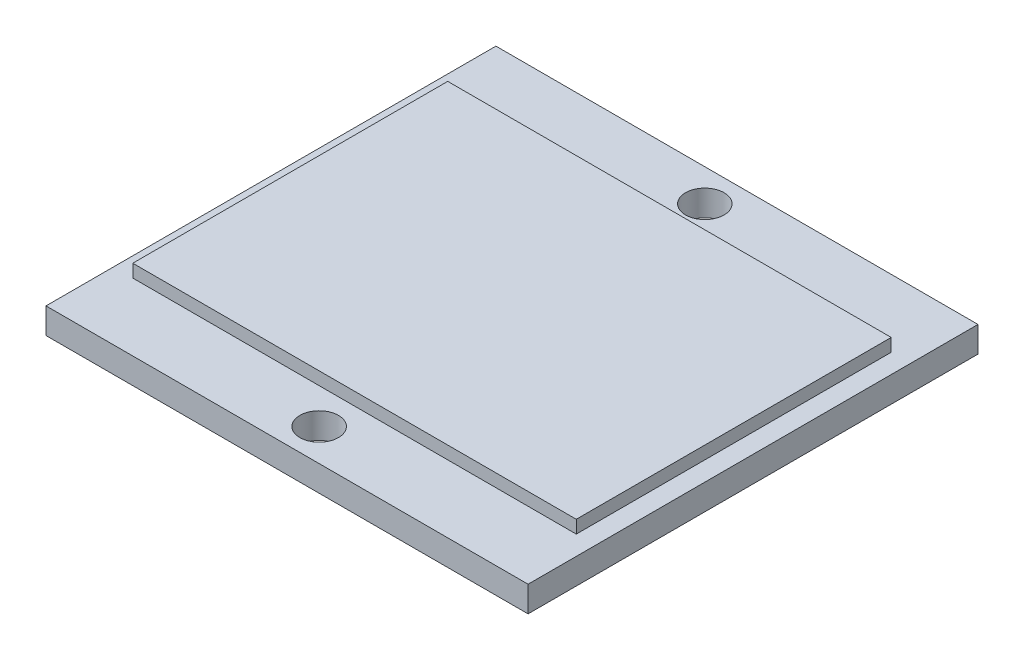
ISO-10303-21;
HEADER;
FILE_DESCRIPTION(('STEP AP214'),'2;1');
FILE_NAME('part.step','',(''),(''),'','','');
FILE_SCHEMA(('AUTOMOTIVE_DESIGN { 1 0 10303 214 1 1 1 1 }'));
ENDSEC;
DATA;
#1=APPLICATION_CONTEXT('core data for automotive mechanical design processes');
#2=APPLICATION_PROTOCOL_DEFINITION('international standard','automotive_design',2000,#1);
#3=PRODUCT_CONTEXT('',#1,'mechanical');
#4=PRODUCT('Part','Part','',(#3));
#5=PRODUCT_RELATED_PRODUCT_CATEGORY('part','',(#4));
#6=PRODUCT_DEFINITION_FORMATION('','',#4);
#7=PRODUCT_DEFINITION_CONTEXT('part definition',#1,'design');
#8=PRODUCT_DEFINITION('design','',#6,#7);
#9=PRODUCT_DEFINITION_SHAPE('','',#8);
#10=(LENGTH_UNIT() NAMED_UNIT(*) SI_UNIT(.MILLI.,.METRE.));
#11=(NAMED_UNIT(*) PLANE_ANGLE_UNIT() SI_UNIT($,.RADIAN.));
#12=(NAMED_UNIT(*) SI_UNIT($,.STERADIAN.) SOLID_ANGLE_UNIT());
#13=UNCERTAINTY_MEASURE_WITH_UNIT(LENGTH_MEASURE(1.E-05),#10,'distance_accuracy_value','');
#14=(GEOMETRIC_REPRESENTATION_CONTEXT(3) GLOBAL_UNCERTAINTY_ASSIGNED_CONTEXT((#13)) GLOBAL_UNIT_ASSIGNED_CONTEXT((#10,
#11,#12)) REPRESENTATION_CONTEXT('',''));
#15=CARTESIAN_POINT('',(0.,0.,0.));
#16=DIRECTION('',(0.,0.,1.));
#17=DIRECTION('',(1.,0.,0.));
#18=AXIS2_PLACEMENT_3D('',#15,#16,#17);
#19=CARTESIAN_POINT('',(0.,4.,0.));
#20=DIRECTION('',(0.,1.,0.));
#21=DIRECTION('',(0.,0.,1.));
#22=AXIS2_PLACEMENT_3D('',#19,#20,#21);
#23=PLANE('',#22);
#24=CARTESIAN_POINT('',(12.5721820460052,4.,45.6524402124825));
#25=DIRECTION('',(0.,1.,0.));
#26=DIRECTION('',(0.,0.,1.));
#27=AXIS2_PLACEMENT_3D('',#24,#25,#26);
#28=CIRCLE('',#27,3.);
#29=CARTESIAN_POINT('',(12.5721820460052,4.,48.6524402124825));
#30=VERTEX_POINT('',#29);
#31=EDGE_CURVE('E212',#30,#30,#28,.T.);
#32=ORIENTED_EDGE('',*,*,#31,.F.);
#33=EDGE_LOOP('',(#32));
#34=FACE_BOUND('',#33,.T.);
#35=CARTESIAN_POINT('',(12.5721820460052,4.,-14.3475597875175));
#36=DIRECTION('',(0.,1.,0.));
#37=DIRECTION('',(0.,0.,1.));
#38=AXIS2_PLACEMENT_3D('',#35,#36,#37);
#39=CIRCLE('',#38,3.);
#40=CARTESIAN_POINT('',(12.5721820460052,4.,-11.3475597875175));
#41=VERTEX_POINT('',#40);
#42=EDGE_CURVE('E214',#41,#41,#39,.T.);
#43=ORIENTED_EDGE('',*,*,#42,.F.);
#44=EDGE_LOOP('',(#43));
#45=FACE_BOUND('',#44,.T.);
#46=DIRECTION('',(0.,0.,1.));
#47=VECTOR('',#46,1.);
#48=CARTESIAN_POINT('',(-24.9278179539948,4.,-19.3475597875175));
#49=LINE('',#48,#47);
#50=CARTESIAN_POINT('',(-24.9278179539948,4.,-19.3475597875175));
#51=VERTEX_POINT('',#50);
#52=CARTESIAN_POINT('',(-24.9278179539948,4.,50.6524402124825));
#53=VERTEX_POINT('',#52);
#54=EDGE_CURVE('E140',#51,#53,#49,.T.);
#55=ORIENTED_EDGE('',*,*,#54,.T.);
#56=DIRECTION('',(1.,0.,0.));
#57=VECTOR('',#56,1.);
#58=CARTESIAN_POINT('',(-24.9278179539948,4.,50.6524402124825));
#59=LINE('',#58,#57);
#60=CARTESIAN_POINT('',(50.0721820460052,4.,50.6524402124825));
#61=VERTEX_POINT('',#60);
#62=EDGE_CURVE('E85',#53,#61,#59,.T.);
#63=ORIENTED_EDGE('',*,*,#62,.T.);
#64=DIRECTION('',(0.,0.,-1.));
#65=VECTOR('',#64,1.);
#66=CARTESIAN_POINT('',(50.0721820460052,4.,-19.3475597875175));
#67=LINE('',#66,#65);
#68=CARTESIAN_POINT('',(50.0721820460052,4.,-19.3475597875175));
#69=VERTEX_POINT('',#68);
#70=EDGE_CURVE('E143',#61,#69,#67,.T.);
#71=ORIENTED_EDGE('',*,*,#70,.T.);
#72=DIRECTION('',(-1.,0.,0.));
#73=VECTOR('',#72,1.);
#74=CARTESIAN_POINT('',(-24.9278179539948,4.,-19.3475597875175));
#75=LINE('',#74,#73);
#76=EDGE_CURVE('E57',#69,#51,#75,.T.);
#77=ORIENTED_EDGE('',*,*,#76,.T.);
#78=EDGE_LOOP('',(#55,#63,#71,#77));
#79=FACE_BOUND('',#78,.T.);
#80=DIRECTION('',(1.,0.,0.));
#81=VECTOR('',#80,1.);
#82=CARTESIAN_POINT('',(-21.9278179539948,4.,40.1524402124825));
#83=LINE('',#82,#81);
#84=CARTESIAN_POINT('',(-21.9278179539948,4.,40.1524402124825));
#85=VERTEX_POINT('',#84);
#86=CARTESIAN_POINT('',(47.0721820460052,4.,40.1524402124825));
#87=VERTEX_POINT('',#86);
#88=EDGE_CURVE('E226',#85,#87,#83,.T.);
#89=ORIENTED_EDGE('',*,*,#88,.F.);
#90=DIRECTION('',(0.,0.,1.));
#91=VECTOR('',#90,1.);
#92=CARTESIAN_POINT('',(-21.9278179539948,4.,40.1524402124825));
#93=LINE('',#92,#91);
#94=CARTESIAN_POINT('',(-21.9278179539948,4.,-8.84755978751747));
#95=VERTEX_POINT('',#94);
#96=EDGE_CURVE('E130',#95,#85,#93,.T.);
#97=ORIENTED_EDGE('',*,*,#96,.F.);
#98=DIRECTION('',(-1.,0.,0.));
#99=VECTOR('',#98,1.);
#100=CARTESIAN_POINT('',(-21.9278179539948,4.,-8.84755978751747));
#101=LINE('',#100,#99);
#102=CARTESIAN_POINT('',(47.0721820460052,4.,-8.84755978751747));
#103=VERTEX_POINT('',#102);
#104=EDGE_CURVE('E126',#103,#95,#101,.T.);
#105=ORIENTED_EDGE('',*,*,#104,.F.);
#106=DIRECTION('',(0.,0.,-1.));
#107=VECTOR('',#106,1.);
#108=CARTESIAN_POINT('',(47.0721820460052,4.,40.1524402124825));
#109=LINE('',#108,#107);
#110=EDGE_CURVE('E228',#87,#103,#109,.T.);
#111=ORIENTED_EDGE('',*,*,#110,.F.);
#112=EDGE_LOOP('',(#89,#97,#105,#111));
#113=FACE_BOUND('',#112,.T.);
#114=ADVANCED_FACE('F33',(#34,#45,#79,#113),#23,.T.);
#115=CARTESIAN_POINT('',(-24.9278179539948,4.,-19.3475597875175));
#116=DIRECTION('',(1.,0.,0.));
#117=DIRECTION('',(0.,0.,-1.));
#118=AXIS2_PLACEMENT_3D('',#115,#116,#117);
#119=PLANE('',#118);
#120=DIRECTION('',(0.,0.,1.));
#121=VECTOR('',#120,1.);
#122=CARTESIAN_POINT('',(-24.9278179539948,0.,-19.3475597875175));
#123=LINE('',#122,#121);
#124=CARTESIAN_POINT('',(-24.9278179539948,0.,-19.3475597875175));
#125=VERTEX_POINT('',#124);
#126=CARTESIAN_POINT('',(-24.9278179539948,0.,50.6524402124825));
#127=VERTEX_POINT('',#126);
#128=EDGE_CURVE('E132',#125,#127,#123,.T.);
#129=ORIENTED_EDGE('',*,*,#128,.T.);
#130=DIRECTION('',(0.,-1.,0.));
#131=VECTOR('',#130,1.);
#132=CARTESIAN_POINT('',(-24.9278179539948,4.,50.6524402124825));
#133=LINE('',#132,#131);
#134=EDGE_CURVE('E11',#53,#127,#133,.T.);
#135=ORIENTED_EDGE('',*,*,#134,.F.);
#136=ORIENTED_EDGE('',*,*,#54,.F.);
#137=DIRECTION('',(0.,-1.,0.));
#138=VECTOR('',#137,1.);
#139=CARTESIAN_POINT('',(-24.9278179539948,4.,-19.3475597875175));
#140=LINE('',#139,#138);
#141=EDGE_CURVE('E145',#51,#125,#140,.T.);
#142=ORIENTED_EDGE('',*,*,#141,.T.);
#143=EDGE_LOOP('',(#129,#135,#136,#142));
#144=FACE_BOUND('',#143,.T.);
#145=ADVANCED_FACE('F35',(#144),#119,.F.);
#146=CARTESIAN_POINT('',(-24.9278179539948,4.,50.6524402124825));
#147=DIRECTION('',(0.,0.,-1.));
#148=DIRECTION('',(-1.,0.,0.));
#149=AXIS2_PLACEMENT_3D('',#146,#147,#148);
#150=PLANE('',#149);
#151=DIRECTION('',(1.,0.,0.));
#152=VECTOR('',#151,1.);
#153=CARTESIAN_POINT('',(-24.9278179539948,0.,50.6524402124825));
#154=LINE('',#153,#152);
#155=CARTESIAN_POINT('',(50.0721820460052,0.,50.6524402124825));
#156=VERTEX_POINT('',#155);
#157=EDGE_CURVE('E135',#127,#156,#154,.T.);
#158=ORIENTED_EDGE('',*,*,#157,.T.);
#159=DIRECTION('',(0.,-1.,0.));
#160=VECTOR('',#159,1.);
#161=CARTESIAN_POINT('',(50.0721820460052,4.,50.6524402124825));
#162=LINE('',#161,#160);
#163=EDGE_CURVE('E41',#61,#156,#162,.T.);
#164=ORIENTED_EDGE('',*,*,#163,.F.);
#165=ORIENTED_EDGE('',*,*,#62,.F.);
#166=ORIENTED_EDGE('',*,*,#134,.T.);
#167=EDGE_LOOP('',(#158,#164,#165,#166));
#168=FACE_BOUND('',#167,.T.);
#169=ADVANCED_FACE('F174',(#168),#150,.F.);
#170=CARTESIAN_POINT('',(50.0721820460052,4.,-19.3475597875175));
#171=DIRECTION('',(-1.,0.,0.));
#172=DIRECTION('',(0.,0.,1.));
#173=AXIS2_PLACEMENT_3D('',#170,#171,#172);
#174=PLANE('',#173);
#175=DIRECTION('',(0.,0.,-1.));
#176=VECTOR('',#175,1.);
#177=CARTESIAN_POINT('',(50.0721820460052,0.,-19.3475597875175));
#178=LINE('',#177,#176);
#179=CARTESIAN_POINT('',(50.0721820460052,0.,-19.3475597875175));
#180=VERTEX_POINT('',#179);
#181=EDGE_CURVE('E148',#156,#180,#178,.T.);
#182=ORIENTED_EDGE('',*,*,#181,.T.);
#183=DIRECTION('',(0.,-1.,0.));
#184=VECTOR('',#183,1.);
#185=CARTESIAN_POINT('',(50.0721820460052,4.,-19.3475597875175));
#186=LINE('',#185,#184);
#187=EDGE_CURVE('E152',#69,#180,#186,.T.);
#188=ORIENTED_EDGE('',*,*,#187,.F.);
#189=ORIENTED_EDGE('',*,*,#70,.F.);
#190=ORIENTED_EDGE('',*,*,#163,.T.);
#191=EDGE_LOOP('',(#182,#188,#189,#190));
#192=FACE_BOUND('',#191,.T.);
#193=ADVANCED_FACE('F157',(#192),#174,.F.);
#194=CARTESIAN_POINT('',(-24.9278179539948,4.,-19.3475597875175));
#195=DIRECTION('',(0.,0.,1.));
#196=DIRECTION('',(1.,0.,0.));
#197=AXIS2_PLACEMENT_3D('',#194,#195,#196);
#198=PLANE('',#197);
#199=DIRECTION('',(-1.,0.,0.));
#200=VECTOR('',#199,1.);
#201=CARTESIAN_POINT('',(-24.9278179539948,0.,-19.3475597875175));
#202=LINE('',#201,#200);
#203=EDGE_CURVE('E78',#180,#125,#202,.T.);
#204=ORIENTED_EDGE('',*,*,#203,.T.);
#205=ORIENTED_EDGE('',*,*,#141,.F.);
#206=ORIENTED_EDGE('',*,*,#76,.F.);
#207=ORIENTED_EDGE('',*,*,#187,.T.);
#208=EDGE_LOOP('',(#204,#205,#206,#207));
#209=FACE_BOUND('',#208,.T.);
#210=ADVANCED_FACE('F165',(#209),#198,.F.);
#211=CARTESIAN_POINT('',(0.,0.,0.));
#212=DIRECTION('',(0.,1.,0.));
#213=DIRECTION('',(0.,0.,1.));
#214=AXIS2_PLACEMENT_3D('',#211,#212,#213);
#215=PLANE('',#214);
#216=CARTESIAN_POINT('',(12.5721820460052,0.,45.6524402124825));
#217=DIRECTION('',(0.,1.,0.));
#218=DIRECTION('',(0.,0.,1.));
#219=AXIS2_PLACEMENT_3D('',#216,#217,#218);
#220=CIRCLE('',#219,3.);
#221=CARTESIAN_POINT('',(12.5721820460052,0.,48.6524402124825));
#222=VERTEX_POINT('',#221);
#223=EDGE_CURVE('E210',#222,#222,#220,.T.);
#224=ORIENTED_EDGE('',*,*,#223,.T.);
#225=EDGE_LOOP('',(#224));
#226=FACE_BOUND('',#225,.T.);
#227=CARTESIAN_POINT('',(12.5721820460052,0.,-14.3475597875175));
#228=DIRECTION('',(0.,1.,0.));
#229=DIRECTION('',(0.,0.,1.));
#230=AXIS2_PLACEMENT_3D('',#227,#228,#229);
#231=CIRCLE('',#230,3.);
#232=CARTESIAN_POINT('',(12.5721820460052,0.,-11.3475597875175));
#233=VERTEX_POINT('',#232);
#234=EDGE_CURVE('E217',#233,#233,#231,.T.);
#235=ORIENTED_EDGE('',*,*,#234,.T.);
#236=EDGE_LOOP('',(#235));
#237=FACE_BOUND('',#236,.T.);
#238=ORIENTED_EDGE('',*,*,#128,.F.);
#239=ORIENTED_EDGE('',*,*,#203,.F.);
#240=ORIENTED_EDGE('',*,*,#181,.F.);
#241=ORIENTED_EDGE('',*,*,#157,.F.);
#242=EDGE_LOOP('',(#238,#239,#240,#241));
#243=FACE_BOUND('',#242,.T.);
#244=ADVANCED_FACE('F161',(#226,#237,#243),#215,.F.);
#245=CARTESIAN_POINT('',(-21.9278179539948,6.,40.1524402124825));
#246=DIRECTION('',(1.,0.,0.));
#247=DIRECTION('',(0.,0.,-1.));
#248=AXIS2_PLACEMENT_3D('',#245,#246,#247);
#249=PLANE('',#248);
#250=ORIENTED_EDGE('',*,*,#96,.T.);
#251=DIRECTION('',(0.,-1.,0.));
#252=VECTOR('',#251,1.);
#253=CARTESIAN_POINT('',(-21.9278179539948,6.,40.1524402124825));
#254=LINE('',#253,#252);
#255=CARTESIAN_POINT('',(-21.9278179539948,6.,40.1524402124825));
#256=VERTEX_POINT('',#255);
#257=EDGE_CURVE('E111',#256,#85,#254,.T.);
#258=ORIENTED_EDGE('',*,*,#257,.F.);
#259=DIRECTION('',(0.,0.,1.));
#260=VECTOR('',#259,1.);
#261=CARTESIAN_POINT('',(-21.9278179539948,6.,40.1524402124825));
#262=LINE('',#261,#260);
#263=CARTESIAN_POINT('',(-21.9278179539948,6.,-8.84755978751747));
#264=VERTEX_POINT('',#263);
#265=EDGE_CURVE('E118',#264,#256,#262,.T.);
#266=ORIENTED_EDGE('',*,*,#265,.F.);
#267=DIRECTION('',(0.,-1.,0.));
#268=VECTOR('',#267,1.);
#269=CARTESIAN_POINT('',(-21.9278179539948,6.,-8.84755978751747));
#270=LINE('',#269,#268);
#271=EDGE_CURVE('E224',#264,#95,#270,.T.);
#272=ORIENTED_EDGE('',*,*,#271,.T.);
#273=EDGE_LOOP('',(#250,#258,#266,#272));
#274=FACE_BOUND('',#273,.T.);
#275=ADVANCED_FACE('F128',(#274),#249,.F.);
#276=CARTESIAN_POINT('',(-21.9278179539948,6.,40.1524402124825));
#277=DIRECTION('',(0.,0.,-1.));
#278=DIRECTION('',(-1.,0.,0.));
#279=AXIS2_PLACEMENT_3D('',#276,#277,#278);
#280=PLANE('',#279);
#281=ORIENTED_EDGE('',*,*,#88,.T.);
#282=DIRECTION('',(0.,-1.,0.));
#283=VECTOR('',#282,1.);
#284=CARTESIAN_POINT('',(47.0721820460052,6.,40.1524402124825));
#285=LINE('',#284,#283);
#286=CARTESIAN_POINT('',(47.0721820460052,6.,40.1524402124825));
#287=VERTEX_POINT('',#286);
#288=EDGE_CURVE('E114',#287,#87,#285,.T.);
#289=ORIENTED_EDGE('',*,*,#288,.F.);
#290=DIRECTION('',(1.,0.,0.));
#291=VECTOR('',#290,1.);
#292=CARTESIAN_POINT('',(-21.9278179539948,6.,40.1524402124825));
#293=LINE('',#292,#291);
#294=EDGE_CURVE('E107',#256,#287,#293,.T.);
#295=ORIENTED_EDGE('',*,*,#294,.F.);
#296=ORIENTED_EDGE('',*,*,#257,.T.);
#297=EDGE_LOOP('',(#281,#289,#295,#296));
#298=FACE_BOUND('',#297,.T.);
#299=ADVANCED_FACE('F109',(#298),#280,.F.);
#300=CARTESIAN_POINT('',(47.0721820460052,6.,40.1524402124825));
#301=DIRECTION('',(-1.,0.,0.));
#302=DIRECTION('',(0.,0.,1.));
#303=AXIS2_PLACEMENT_3D('',#300,#301,#302);
#304=PLANE('',#303);
#305=ORIENTED_EDGE('',*,*,#110,.T.);
#306=DIRECTION('',(0.,-1.,0.));
#307=VECTOR('',#306,1.);
#308=CARTESIAN_POINT('',(47.0721820460052,6.,-8.84755978751747));
#309=LINE('',#308,#307);
#310=CARTESIAN_POINT('',(47.0721820460052,6.,-8.84755978751747));
#311=VERTEX_POINT('',#310);
#312=EDGE_CURVE('E48',#311,#103,#309,.T.);
#313=ORIENTED_EDGE('',*,*,#312,.F.);
#314=DIRECTION('',(0.,0.,-1.));
#315=VECTOR('',#314,1.);
#316=CARTESIAN_POINT('',(47.0721820460052,6.,40.1524402124825));
#317=LINE('',#316,#315);
#318=EDGE_CURVE('E117',#287,#311,#317,.T.);
#319=ORIENTED_EDGE('',*,*,#318,.F.);
#320=ORIENTED_EDGE('',*,*,#288,.T.);
#321=EDGE_LOOP('',(#305,#313,#319,#320));
#322=FACE_BOUND('',#321,.T.);
#323=ADVANCED_FACE('F189',(#322),#304,.F.);
#324=CARTESIAN_POINT('',(-21.9278179539948,6.,-8.84755978751747));
#325=DIRECTION('',(0.,0.,1.));
#326=DIRECTION('',(1.,0.,0.));
#327=AXIS2_PLACEMENT_3D('',#324,#325,#326);
#328=PLANE('',#327);
#329=ORIENTED_EDGE('',*,*,#104,.T.);
#330=ORIENTED_EDGE('',*,*,#271,.F.);
#331=DIRECTION('',(-1.,0.,0.));
#332=VECTOR('',#331,1.);
#333=CARTESIAN_POINT('',(-21.9278179539948,6.,-8.84755978751747));
#334=LINE('',#333,#332);
#335=EDGE_CURVE('E122',#311,#264,#334,.T.);
#336=ORIENTED_EDGE('',*,*,#335,.F.);
#337=ORIENTED_EDGE('',*,*,#312,.T.);
#338=EDGE_LOOP('',(#329,#330,#336,#337));
#339=FACE_BOUND('',#338,.T.);
#340=ADVANCED_FACE('F192',(#339),#328,.F.);
#341=CARTESIAN_POINT('',(0.,6.,0.));
#342=DIRECTION('',(0.,-1.,0.));
#343=DIRECTION('',(0.,0.,-1.));
#344=AXIS2_PLACEMENT_3D('',#341,#342,#343);
#345=PLANE('',#344);
#346=ORIENTED_EDGE('',*,*,#265,.T.);
#347=ORIENTED_EDGE('',*,*,#294,.T.);
#348=ORIENTED_EDGE('',*,*,#318,.T.);
#349=ORIENTED_EDGE('',*,*,#335,.T.);
#350=EDGE_LOOP('',(#346,#347,#348,#349));
#351=FACE_BOUND('',#350,.T.);
#352=ADVANCED_FACE('F121',(#351),#345,.F.);
#353=CARTESIAN_POINT('',(12.5721820460052,0.,-14.3475597875175));
#354=DIRECTION('',(0.,1.,0.));
#355=DIRECTION('',(0.,0.,1.));
#356=AXIS2_PLACEMENT_3D('',#353,#354,#355);
#357=CYLINDRICAL_SURFACE('',#356,3.);
#358=ORIENTED_EDGE('',*,*,#234,.F.);
#359=EDGE_LOOP('',(#358));
#360=FACE_BOUND('',#359,.T.);
#361=ORIENTED_EDGE('',*,*,#42,.T.);
#362=EDGE_LOOP('',(#361));
#363=FACE_BOUND('',#362,.T.);
#364=ADVANCED_FACE('F198',(#360,#363),#357,.F.);
#365=CARTESIAN_POINT('',(12.5721820460052,0.,45.6524402124825));
#366=DIRECTION('',(0.,1.,0.));
#367=DIRECTION('',(0.,0.,1.));
#368=AXIS2_PLACEMENT_3D('',#365,#366,#367);
#369=CYLINDRICAL_SURFACE('',#368,3.);
#370=ORIENTED_EDGE('',*,*,#223,.F.);
#371=EDGE_LOOP('',(#370));
#372=FACE_BOUND('',#371,.T.);
#373=ORIENTED_EDGE('',*,*,#31,.T.);
#374=EDGE_LOOP('',(#373));
#375=FACE_BOUND('',#374,.T.);
#376=ADVANCED_FACE('F201',(#372,#375),#369,.F.);
#377=CLOSED_SHELL('',(#114,#145,#169,#193,#210,#244,#275,#299,#323,#340,#352,#364,#376));
#378=MANIFOLD_SOLID_BREP('B2',#377);
#379=ADVANCED_BREP_SHAPE_REPRESENTATION('',(#18,#378),#14);
#380=SHAPE_DEFINITION_REPRESENTATION(#9,#379);
ENDSEC;
END-ISO-10303-21;
